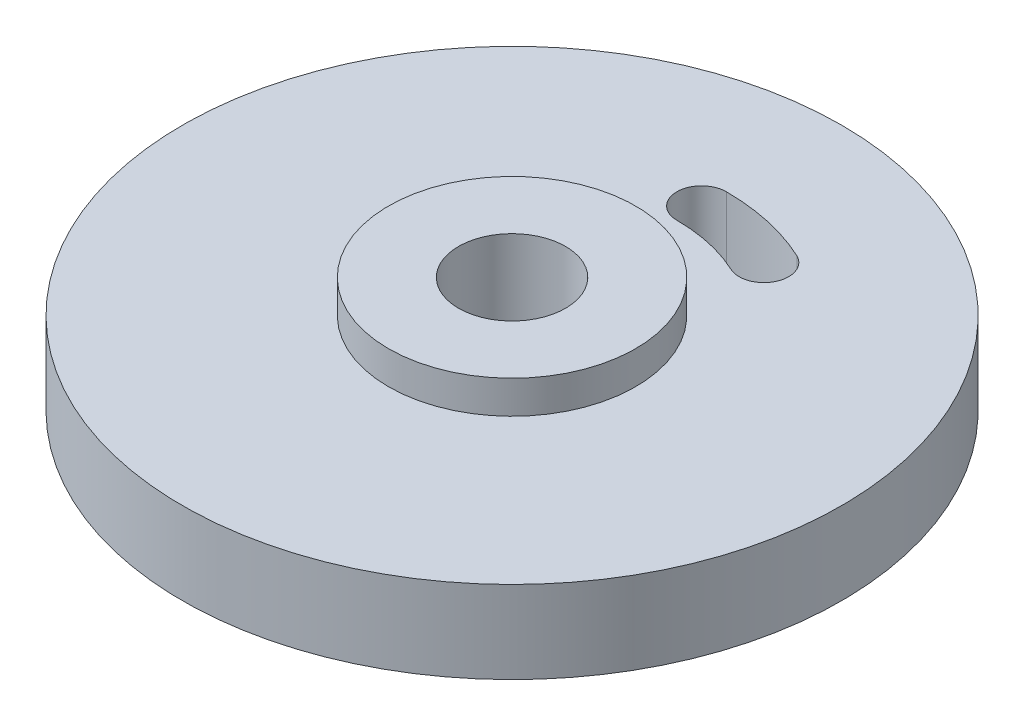
ISO-10303-21;
HEADER;
FILE_DESCRIPTION(('STEP AP214'),'2;1');
FILE_NAME('part.step','',(''),(''),'','','');
FILE_SCHEMA(('AUTOMOTIVE_DESIGN { 1 0 10303 214 1 1 1 1 }'));
ENDSEC;
DATA;
#1=APPLICATION_CONTEXT('core data for automotive mechanical design processes');
#2=APPLICATION_PROTOCOL_DEFINITION('international standard','automotive_design',2000,#1);
#3=PRODUCT_CONTEXT('',#1,'mechanical');
#4=PRODUCT('Part','Part','',(#3));
#5=PRODUCT_RELATED_PRODUCT_CATEGORY('part','',(#4));
#6=PRODUCT_DEFINITION_FORMATION('','',#4);
#7=PRODUCT_DEFINITION_CONTEXT('part definition',#1,'design');
#8=PRODUCT_DEFINITION('design','',#6,#7);
#9=PRODUCT_DEFINITION_SHAPE('','',#8);
#10=(LENGTH_UNIT() NAMED_UNIT(*) SI_UNIT(.MILLI.,.METRE.));
#11=(NAMED_UNIT(*) PLANE_ANGLE_UNIT() SI_UNIT($,.RADIAN.));
#12=(NAMED_UNIT(*) SI_UNIT($,.STERADIAN.) SOLID_ANGLE_UNIT());
#13=UNCERTAINTY_MEASURE_WITH_UNIT(LENGTH_MEASURE(1.E-05),#10,'distance_accuracy_value','');
#14=(GEOMETRIC_REPRESENTATION_CONTEXT(3) GLOBAL_UNCERTAINTY_ASSIGNED_CONTEXT((#13)) GLOBAL_UNIT_ASSIGNED_CONTEXT((#10,
#11,#12)) REPRESENTATION_CONTEXT('',''));
#15=CARTESIAN_POINT('',(0.,0.,0.));
#16=DIRECTION('',(0.,0.,1.));
#17=DIRECTION('',(1.,0.,0.));
#18=AXIS2_PLACEMENT_3D('',#15,#16,#17);
#19=CARTESIAN_POINT('',(20.,14.,0.));
#20=DIRECTION('',(0.,1.,0.));
#21=DIRECTION('',(0.,0.,1.));
#22=AXIS2_PLACEMENT_3D('',#19,#20,#21);
#23=PLANE('',#22);
#24=CARTESIAN_POINT('',(0.,14.,0.));
#25=DIRECTION('',(0.,1.,0.));
#26=DIRECTION('',(0.,0.,1.));
#27=AXIS2_PLACEMENT_3D('',#24,#25,#26);
#28=CIRCLE('',#27,7.5);
#29=CARTESIAN_POINT('',(0.,14.,7.5));
#30=VERTEX_POINT('',#29);
#31=EDGE_CURVE('E11',#30,#30,#28,.T.);
#32=ORIENTED_EDGE('',*,*,#31,.F.);
#33=EDGE_LOOP('',(#32));
#34=FACE_BOUND('',#33,.T.);
#35=CARTESIAN_POINT('',(0.,14.,0.));
#36=DIRECTION('',(0.,1.,0.));
#37=DIRECTION('',(0.,0.,1.));
#38=AXIS2_PLACEMENT_3D('',#35,#36,#37);
#39=CIRCLE('',#38,10.);
#40=CARTESIAN_POINT('',(0.,14.,-10.));
#41=VERTEX_POINT('',#40);
#42=CARTESIAN_POINT('',(4.22618261740694,14.,-9.06307787036653));
#43=VERTEX_POINT('',#42);
#44=EDGE_CURVE('E108',#41,#43,#39,.F.);
#45=ORIENTED_EDGE('',*,*,#44,.F.);
#46=CARTESIAN_POINT('',(0.,14.,-11.5));
#47=DIRECTION('',(0.,1.,0.));
#48=DIRECTION('',(0.,0.,1.));
#49=AXIS2_PLACEMENT_3D('',#46,#47,#48);
#50=CIRCLE('',#49,1.5);
#51=CARTESIAN_POINT('',(0.,14.,-13.));
#52=VERTEX_POINT('',#51);
#53=EDGE_CURVE('E111',#52,#41,#50,.T.);
#54=ORIENTED_EDGE('',*,*,#53,.F.);
#55=CARTESIAN_POINT('',(0.,14.,0.));
#56=DIRECTION('',(0.,1.,0.));
#57=DIRECTION('',(0.,0.,1.));
#58=AXIS2_PLACEMENT_3D('',#55,#56,#57);
#59=CIRCLE('',#58,13.);
#60=CARTESIAN_POINT('',(5.49403740262901,14.,-11.7820012314765));
#61=VERTEX_POINT('',#60);
#62=EDGE_CURVE('E92',#61,#52,#59,.T.);
#63=ORIENTED_EDGE('',*,*,#62,.F.);
#64=CARTESIAN_POINT('',(4.86011001001797,14.,-10.4225395509215));
#65=DIRECTION('',(0.,1.,0.));
#66=DIRECTION('',(0.,0.,1.));
#67=AXIS2_PLACEMENT_3D('',#64,#65,#66);
#68=CIRCLE('',#67,1.5);
#69=EDGE_CURVE('E52',#43,#61,#68,.T.);
#70=ORIENTED_EDGE('',*,*,#69,.F.);
#71=EDGE_LOOP('',(#45,#54,#63,#70));
#72=FACE_BOUND('',#71,.T.);
#73=CARTESIAN_POINT('',(0.,14.,0.));
#74=DIRECTION('',(0.,-1.,0.));
#75=DIRECTION('',(0.,0.,-1.));
#76=AXIS2_PLACEMENT_3D('',#73,#74,#75);
#77=CIRCLE('',#76,20.);
#78=CARTESIAN_POINT('',(0.,14.,-20.));
#79=VERTEX_POINT('',#78);
#80=EDGE_CURVE('E118',#79,#79,#77,.T.);
#81=ORIENTED_EDGE('',*,*,#80,.F.);
#82=EDGE_LOOP('',(#81));
#83=FACE_BOUND('',#82,.T.);
#84=ADVANCED_FACE('F37',(#34,#72,#83),#23,.T.);
#85=CARTESIAN_POINT('',(5.,9.,0.));
#86=DIRECTION('',(0.,-1.,0.));
#87=DIRECTION('',(0.,0.,-1.));
#88=AXIS2_PLACEMENT_3D('',#85,#86,#87);
#89=PLANE('',#88);
#90=CARTESIAN_POINT('',(0.,9.,0.));
#91=DIRECTION('',(0.,-1.,0.));
#92=DIRECTION('',(0.,0.,-1.));
#93=AXIS2_PLACEMENT_3D('',#90,#91,#92);
#94=CIRCLE('',#93,7.5);
#95=CARTESIAN_POINT('',(0.,9.,-7.5));
#96=VERTEX_POINT('',#95);
#97=EDGE_CURVE('E40',#96,#96,#94,.T.);
#98=ORIENTED_EDGE('',*,*,#97,.F.);
#99=EDGE_LOOP('',(#98));
#100=FACE_BOUND('',#99,.T.);
#101=CARTESIAN_POINT('',(0.,9.,0.));
#102=DIRECTION('',(0.,-1.,0.));
#103=DIRECTION('',(0.,0.,-1.));
#104=AXIS2_PLACEMENT_3D('',#101,#102,#103);
#105=CIRCLE('',#104,13.);
#106=CARTESIAN_POINT('',(0.,9.,-13.));
#107=VERTEX_POINT('',#106);
#108=CARTESIAN_POINT('',(5.49403740262901,9.,-11.7820012314765));
#109=VERTEX_POINT('',#108);
#110=EDGE_CURVE('E89',#107,#109,#105,.T.);
#111=ORIENTED_EDGE('',*,*,#110,.F.);
#112=CARTESIAN_POINT('',(0.,9.,-11.5));
#113=DIRECTION('',(0.,-1.,0.));
#114=DIRECTION('',(0.,0.,-1.));
#115=AXIS2_PLACEMENT_3D('',#112,#113,#114);
#116=CIRCLE('',#115,1.5);
#117=CARTESIAN_POINT('',(0.,9.,-10.));
#118=VERTEX_POINT('',#117);
#119=EDGE_CURVE('E60',#118,#107,#116,.T.);
#120=ORIENTED_EDGE('',*,*,#119,.F.);
#121=CARTESIAN_POINT('',(0.,9.,0.));
#122=DIRECTION('',(0.,-1.,0.));
#123=DIRECTION('',(0.,0.,-1.));
#124=AXIS2_PLACEMENT_3D('',#121,#122,#123);
#125=CIRCLE('',#124,10.);
#126=CARTESIAN_POINT('',(4.22618261740694,9.,-9.06307787036653));
#127=VERTEX_POINT('',#126);
#128=EDGE_CURVE('E98',#127,#118,#125,.F.);
#129=ORIENTED_EDGE('',*,*,#128,.F.);
#130=CARTESIAN_POINT('',(4.86011001001797,9.,-10.4225395509215));
#131=DIRECTION('',(0.,-1.,0.));
#132=DIRECTION('',(0.,0.,-1.));
#133=AXIS2_PLACEMENT_3D('',#130,#131,#132);
#134=CIRCLE('',#133,1.5);
#135=EDGE_CURVE('E80',#109,#127,#134,.T.);
#136=ORIENTED_EDGE('',*,*,#135,.F.);
#137=EDGE_LOOP('',(#111,#120,#129,#136));
#138=FACE_BOUND('',#137,.T.);
#139=CARTESIAN_POINT('',(0.,9.,0.));
#140=DIRECTION('',(0.,-1.,0.));
#141=DIRECTION('',(0.,0.,-1.));
#142=AXIS2_PLACEMENT_3D('',#139,#140,#141);
#143=CIRCLE('',#142,20.);
#144=CARTESIAN_POINT('',(0.,9.,-20.));
#145=VERTEX_POINT('',#144);
#146=EDGE_CURVE('E120',#145,#145,#143,.T.);
#147=ORIENTED_EDGE('',*,*,#146,.T.);
#148=EDGE_LOOP('',(#147));
#149=FACE_BOUND('',#148,.T.);
#150=ADVANCED_FACE('F95',(#100,#138,#149),#89,.T.);
#151=CARTESIAN_POINT('',(0.,0.,0.));
#152=DIRECTION('',(0.,-1.,0.));
#153=DIRECTION('',(0.,0.,-1.));
#154=AXIS2_PLACEMENT_3D('',#151,#152,#153);
#155=CYLINDRICAL_SURFACE('',#154,20.);
#156=ORIENTED_EDGE('',*,*,#80,.T.);
#157=EDGE_LOOP('',(#156));
#158=FACE_BOUND('',#157,.T.);
#159=ORIENTED_EDGE('',*,*,#146,.F.);
#160=EDGE_LOOP('',(#159));
#161=FACE_BOUND('',#160,.T.);
#162=ADVANCED_FACE('F130',(#158,#161),#155,.T.);
#163=CARTESIAN_POINT('',(0.,14.001,-11.5));
#164=DIRECTION('',(0.,-1.,0.));
#165=DIRECTION('',(0.,0.,-1.));
#166=AXIS2_PLACEMENT_3D('',#163,#164,#165);
#167=CYLINDRICAL_SURFACE('',#166,1.5);
#168=ORIENTED_EDGE('',*,*,#53,.T.);
#169=DIRECTION('',(0.,-1.,0.));
#170=VECTOR('',#169,1.);
#171=CARTESIAN_POINT('',(0.,14.001,-10.));
#172=LINE('',#171,#170);
#173=EDGE_CURVE('E93',#41,#118,#172,.T.);
#174=ORIENTED_EDGE('',*,*,#173,.T.);
#175=ORIENTED_EDGE('',*,*,#119,.T.);
#176=DIRECTION('',(0.,-1.,0.));
#177=VECTOR('',#176,1.);
#178=CARTESIAN_POINT('',(0.,14.001,-13.));
#179=LINE('',#178,#177);
#180=EDGE_CURVE('E86',#52,#107,#179,.T.);
#181=ORIENTED_EDGE('',*,*,#180,.F.);
#182=EDGE_LOOP('',(#168,#174,#175,#181));
#183=FACE_BOUND('',#182,.T.);
#184=ADVANCED_FACE('F136',(#183),#167,.F.);
#185=CARTESIAN_POINT('',(0.,14.001,0.));
#186=DIRECTION('',(0.,-1.,0.));
#187=DIRECTION('',(0.,0.,-1.));
#188=AXIS2_PLACEMENT_3D('',#185,#186,#187);
#189=CYLINDRICAL_SURFACE('',#188,10.);
#190=ORIENTED_EDGE('',*,*,#44,.T.);
#191=DIRECTION('',(0.,-1.,0.));
#192=VECTOR('',#191,1.);
#193=CARTESIAN_POINT('',(4.22618261740694,14.001,-9.06307787036653));
#194=LINE('',#193,#192);
#195=EDGE_CURVE('E85',#43,#127,#194,.T.);
#196=ORIENTED_EDGE('',*,*,#195,.T.);
#197=ORIENTED_EDGE('',*,*,#128,.T.);
#198=ORIENTED_EDGE('',*,*,#173,.F.);
#199=EDGE_LOOP('',(#190,#196,#197,#198));
#200=FACE_BOUND('',#199,.T.);
#201=ADVANCED_FACE('F178',(#200),#189,.T.);
#202=CARTESIAN_POINT('',(4.86011001001797,14.001,-10.4225395509215));
#203=DIRECTION('',(0.,-1.,0.));
#204=DIRECTION('',(0.,0.,-1.));
#205=AXIS2_PLACEMENT_3D('',#202,#203,#204);
#206=CYLINDRICAL_SURFACE('',#205,1.5);
#207=ORIENTED_EDGE('',*,*,#69,.T.);
#208=DIRECTION('',(0.,-1.,0.));
#209=VECTOR('',#208,1.);
#210=CARTESIAN_POINT('',(5.49403740262901,14.001,-11.7820012314765));
#211=LINE('',#210,#209);
#212=EDGE_CURVE('E76',#61,#109,#211,.T.);
#213=ORIENTED_EDGE('',*,*,#212,.T.);
#214=ORIENTED_EDGE('',*,*,#135,.T.);
#215=ORIENTED_EDGE('',*,*,#195,.F.);
#216=EDGE_LOOP('',(#207,#213,#214,#215));
#217=FACE_BOUND('',#216,.T.);
#218=ADVANCED_FACE('F78',(#217),#206,.F.);
#219=CARTESIAN_POINT('',(0.,14.001,0.));
#220=DIRECTION('',(0.,-1.,0.));
#221=DIRECTION('',(0.,0.,-1.));
#222=AXIS2_PLACEMENT_3D('',#219,#220,#221);
#223=CYLINDRICAL_SURFACE('',#222,13.);
#224=ORIENTED_EDGE('',*,*,#62,.T.);
#225=ORIENTED_EDGE('',*,*,#180,.T.);
#226=ORIENTED_EDGE('',*,*,#110,.T.);
#227=ORIENTED_EDGE('',*,*,#212,.F.);
#228=EDGE_LOOP('',(#224,#225,#226,#227));
#229=FACE_BOUND('',#228,.T.);
#230=ADVANCED_FACE('F90',(#229),#223,.F.);
#231=CARTESIAN_POINT('',(0.,7.,0.));
#232=DIRECTION('',(0.,1.,0.));
#233=DIRECTION('',(0.,0.,1.));
#234=AXIS2_PLACEMENT_3D('',#231,#232,#233);
#235=PLANE('',#234);
#236=CARTESIAN_POINT('',(0.,7.,0.));
#237=DIRECTION('',(0.,1.,0.));
#238=DIRECTION('',(0.,0.,1.));
#239=AXIS2_PLACEMENT_3D('',#236,#237,#238);
#240=CIRCLE('',#239,3.25);
#241=CARTESIAN_POINT('',(0.,7.,3.25));
#242=VERTEX_POINT('',#241);
#243=EDGE_CURVE('E103',#242,#242,#240,.T.);
#244=ORIENTED_EDGE('',*,*,#243,.T.);
#245=EDGE_LOOP('',(#244));
#246=FACE_BOUND('',#245,.T.);
#247=CARTESIAN_POINT('',(0.,7.,0.));
#248=DIRECTION('',(0.,1.,0.));
#249=DIRECTION('',(0.,0.,1.));
#250=AXIS2_PLACEMENT_3D('',#247,#248,#249);
#251=CIRCLE('',#250,7.5);
#252=CARTESIAN_POINT('',(0.,7.,7.5));
#253=VERTEX_POINT('',#252);
#254=EDGE_CURVE('E99',#253,#253,#251,.T.);
#255=ORIENTED_EDGE('',*,*,#254,.F.);
#256=EDGE_LOOP('',(#255));
#257=FACE_BOUND('',#256,.T.);
#258=ADVANCED_FACE('F152',(#246,#257),#235,.F.);
#259=CARTESIAN_POINT('',(0.,7.,0.));
#260=DIRECTION('',(0.,1.,0.));
#261=DIRECTION('',(0.,0.,1.));
#262=AXIS2_PLACEMENT_3D('',#259,#260,#261);
#263=CYLINDRICAL_SURFACE('',#262,7.5);
#264=ORIENTED_EDGE('',*,*,#97,.T.);
#265=EDGE_LOOP('',(#264));
#266=FACE_BOUND('',#265,.T.);
#267=ORIENTED_EDGE('',*,*,#254,.T.);
#268=EDGE_LOOP('',(#267));
#269=FACE_BOUND('',#268,.T.);
#270=ADVANCED_FACE('F126',(#266,#269),#263,.T.);
#271=CARTESIAN_POINT('',(0.,0.,0.));
#272=DIRECTION('',(0.,-1.,0.));
#273=DIRECTION('',(0.,0.,-1.));
#274=AXIS2_PLACEMENT_3D('',#271,#272,#273);
#275=CYLINDRICAL_SURFACE('',#274,3.25);
#276=ORIENTED_EDGE('',*,*,#243,.F.);
#277=EDGE_LOOP('',(#276));
#278=FACE_BOUND('',#277,.T.);
#279=CARTESIAN_POINT('',(0.,16.,0.));
#280=DIRECTION('',(0.,1.,0.));
#281=DIRECTION('',(0.,0.,1.));
#282=AXIS2_PLACEMENT_3D('',#279,#280,#281);
#283=CIRCLE('',#282,3.25);
#284=CARTESIAN_POINT('',(0.,16.,3.25));
#285=VERTEX_POINT('',#284);
#286=EDGE_CURVE('E158',#285,#285,#283,.T.);
#287=ORIENTED_EDGE('',*,*,#286,.T.);
#288=EDGE_LOOP('',(#287));
#289=FACE_BOUND('',#288,.T.);
#290=ADVANCED_FACE('F141',(#278,#289),#275,.F.);
#291=ORIENTED_EDGE('',*,*,#31,.T.);
#292=EDGE_LOOP('',(#291));
#293=FACE_BOUND('',#292,.T.);
#294=CARTESIAN_POINT('',(0.,16.,0.));
#295=DIRECTION('',(0.,1.,0.));
#296=DIRECTION('',(0.,0.,1.));
#297=AXIS2_PLACEMENT_3D('',#294,#295,#296);
#298=CIRCLE('',#297,7.5);
#299=CARTESIAN_POINT('',(0.,16.,7.5));
#300=VERTEX_POINT('',#299);
#301=EDGE_CURVE('E160',#300,#300,#298,.T.);
#302=ORIENTED_EDGE('',*,*,#301,.F.);
#303=EDGE_LOOP('',(#302));
#304=FACE_BOUND('',#303,.T.);
#305=ADVANCED_FACE('F143',(#293,#304),#263,.T.);
#306=CARTESIAN_POINT('',(0.,16.,0.));
#307=DIRECTION('',(0.,1.,0.));
#308=DIRECTION('',(0.,0.,1.));
#309=AXIS2_PLACEMENT_3D('',#306,#307,#308);
#310=PLANE('',#309);
#311=ORIENTED_EDGE('',*,*,#301,.T.);
#312=EDGE_LOOP('',(#311));
#313=FACE_BOUND('',#312,.T.);
#314=ORIENTED_EDGE('',*,*,#286,.F.);
#315=EDGE_LOOP('',(#314));
#316=FACE_BOUND('',#315,.T.);
#317=ADVANCED_FACE('F149',(#313,#316),#310,.T.);
#318=CLOSED_SHELL('',(#84,#150,#162,#184,#201,#218,#230,#258,#270,#290,#305,#317));
#319=MANIFOLD_SOLID_BREP('B2',#318);
#320=ADVANCED_BREP_SHAPE_REPRESENTATION('',(#18,#319),#14);
#321=SHAPE_DEFINITION_REPRESENTATION(#9,#320);
ENDSEC;
END-ISO-10303-21;
